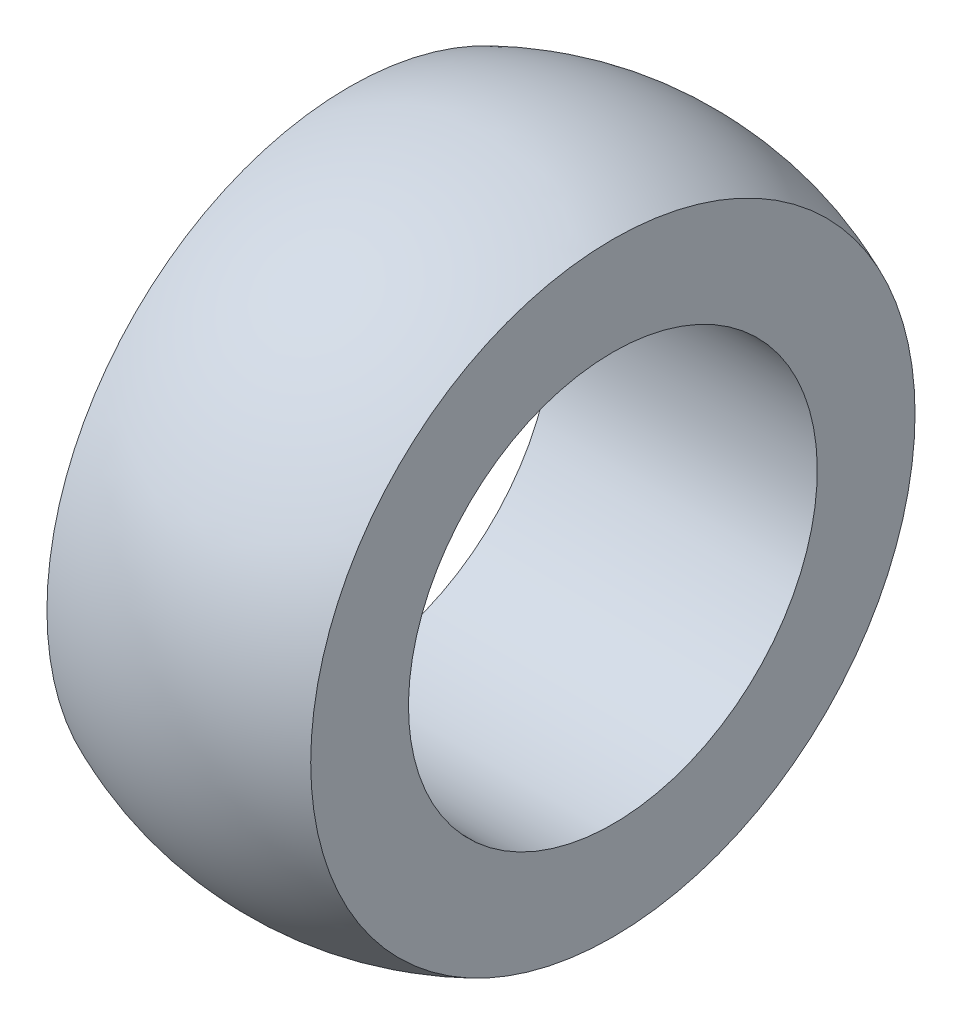
ISO-10303-21;
HEADER;
FILE_DESCRIPTION(('STEP AP214'),'2;1');
FILE_NAME('part.step','',(''),(''),'','','');
FILE_SCHEMA(('AUTOMOTIVE_DESIGN { 1 0 10303 214 1 1 1 1 }'));
ENDSEC;
DATA;
#1=APPLICATION_CONTEXT('core data for automotive mechanical design processes');
#2=APPLICATION_PROTOCOL_DEFINITION('international standard','automotive_design',2000,#1);
#3=PRODUCT_CONTEXT('',#1,'mechanical');
#4=PRODUCT('Part','Part','',(#3));
#5=PRODUCT_RELATED_PRODUCT_CATEGORY('part','',(#4));
#6=PRODUCT_DEFINITION_FORMATION('','',#4);
#7=PRODUCT_DEFINITION_CONTEXT('part definition',#1,'design');
#8=PRODUCT_DEFINITION('design','',#6,#7);
#9=PRODUCT_DEFINITION_SHAPE('','',#8);
#10=(LENGTH_UNIT() NAMED_UNIT(*) SI_UNIT(.MILLI.,.METRE.));
#11=(NAMED_UNIT(*) PLANE_ANGLE_UNIT() SI_UNIT($,.RADIAN.));
#12=(NAMED_UNIT(*) SI_UNIT($,.STERADIAN.) SOLID_ANGLE_UNIT());
#13=UNCERTAINTY_MEASURE_WITH_UNIT(LENGTH_MEASURE(1.E-05),#10,'distance_accuracy_value','');
#14=(GEOMETRIC_REPRESENTATION_CONTEXT(3) GLOBAL_UNCERTAINTY_ASSIGNED_CONTEXT((#13)) GLOBAL_UNIT_ASSIGNED_CONTEXT((#10,
#11,#12)) REPRESENTATION_CONTEXT('',''));
#15=CARTESIAN_POINT('',(0.,0.,0.));
#16=DIRECTION('',(0.,0.,1.));
#17=DIRECTION('',(1.,0.,0.));
#18=AXIS2_PLACEMENT_3D('',#15,#16,#17);
#19=CARTESIAN_POINT('',(11.3858972489895,0.,0.));
#20=DIRECTION('',(1.,0.,0.));
#21=DIRECTION('',(0.,1.,0.));
#22=AXIS2_PLACEMENT_3D('',#19,#20,#21);
#23=CYLINDRICAL_SURFACE('',#22,3.937);
#24=CARTESIAN_POINT('',(2.54,0.,0.));
#25=DIRECTION('',(1.,0.,0.));
#26=DIRECTION('',(0.,1.,0.));
#27=AXIS2_PLACEMENT_3D('',#24,#25,#26);
#28=CIRCLE('',#27,3.937);
#29=CARTESIAN_POINT('',(2.54,3.937,0.));
#30=VERTEX_POINT('',#29);
#31=EDGE_CURVE('E10',#30,#30,#28,.T.);
#32=ORIENTED_EDGE('',*,*,#31,.T.);
#33=EDGE_LOOP('',(#32));
#34=FACE_BOUND('',#33,.T.);
#35=CARTESIAN_POINT('',(-2.54,0.,0.));
#36=DIRECTION('',(1.,0.,0.));
#37=DIRECTION('',(0.,1.,0.));
#38=AXIS2_PLACEMENT_3D('',#35,#36,#37);
#39=CIRCLE('',#38,3.937);
#40=CARTESIAN_POINT('',(-2.54,3.937,0.));
#41=VERTEX_POINT('',#40);
#42=EDGE_CURVE('E54',#41,#41,#39,.T.);
#43=ORIENTED_EDGE('',*,*,#42,.F.);
#44=EDGE_LOOP('',(#43));
#45=FACE_BOUND('',#44,.T.);
#46=ADVANCED_FACE('F37',(#34,#45),#23,.F.);
#47=CARTESIAN_POINT('',(2.54,3.937,0.));
#48=DIRECTION('',(1.,0.,0.));
#49=DIRECTION('',(0.,1.,0.));
#50=AXIS2_PLACEMENT_3D('',#47,#48,#49);
#51=PLANE('',#50);
#52=CARTESIAN_POINT('',(2.54,0.,0.));
#53=DIRECTION('',(1.,0.,0.));
#54=DIRECTION('',(0.,1.,0.));
#55=AXIS2_PLACEMENT_3D('',#52,#53,#54);
#56=CIRCLE('',#55,5.81987113259392);
#57=CARTESIAN_POINT('',(2.54,5.81987113259392,0.));
#58=VERTEX_POINT('',#57);
#59=EDGE_CURVE('E44',#58,#58,#56,.T.);
#60=ORIENTED_EDGE('',*,*,#59,.T.);
#61=EDGE_LOOP('',(#60));
#62=FACE_BOUND('',#61,.T.);
#63=ORIENTED_EDGE('',*,*,#31,.F.);
#64=EDGE_LOOP('',(#63));
#65=FACE_BOUND('',#64,.T.);
#66=ADVANCED_FACE('F65',(#62,#65),#51,.T.);
#67=CARTESIAN_POINT('',(0.,0.,0.));
#68=DIRECTION('',(1.,0.,0.));
#69=DIRECTION('',(0.,1.,0.));
#70=AXIS2_PLACEMENT_3D('',#67,#68,#69);
#71=SPHERICAL_SURFACE('',#70,6.35);
#72=CARTESIAN_POINT('',(-2.54,0.,0.));
#73=DIRECTION('',(1.,0.,0.));
#74=DIRECTION('',(0.,1.,0.));
#75=AXIS2_PLACEMENT_3D('',#72,#73,#74);
#76=CIRCLE('',#75,5.81987113259392);
#77=CARTESIAN_POINT('',(-2.54,5.81987113259392,0.));
#78=VERTEX_POINT('',#77);
#79=EDGE_CURVE('E49',#78,#78,#76,.T.);
#80=ORIENTED_EDGE('',*,*,#79,.T.);
#81=EDGE_LOOP('',(#80));
#82=FACE_BOUND('',#81,.T.);
#83=ORIENTED_EDGE('',*,*,#59,.F.);
#84=EDGE_LOOP('',(#83));
#85=FACE_BOUND('',#84,.T.);
#86=ADVANCED_FACE('F69',(#82,#85),#71,.T.);
#87=CARTESIAN_POINT('',(-2.54,3.937,0.));
#88=DIRECTION('',(-1.,0.,0.));
#89=DIRECTION('',(0.,-1.,0.));
#90=AXIS2_PLACEMENT_3D('',#87,#88,#89);
#91=PLANE('',#90);
#92=ORIENTED_EDGE('',*,*,#42,.T.);
#93=EDGE_LOOP('',(#92));
#94=FACE_BOUND('',#93,.T.);
#95=ORIENTED_EDGE('',*,*,#79,.F.);
#96=EDGE_LOOP('',(#95));
#97=FACE_BOUND('',#96,.T.);
#98=ADVANCED_FACE('F61',(#94,#97),#91,.T.);
#99=CLOSED_SHELL('',(#46,#66,#86,#98));
#100=MANIFOLD_SOLID_BREP('B2',#99);
#101=ADVANCED_BREP_SHAPE_REPRESENTATION('',(#18,#100),#14);
#102=SHAPE_DEFINITION_REPRESENTATION(#9,#101);
ENDSEC;
END-ISO-10303-21;
